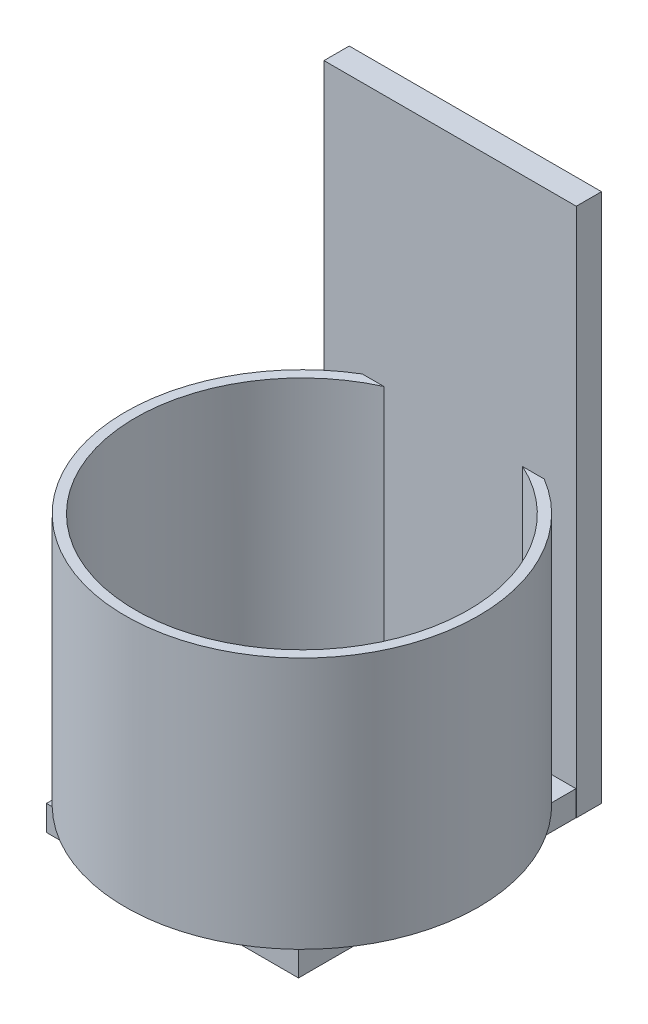
ISO-10303-21;
HEADER;
FILE_DESCRIPTION(('STEP AP214'),'2;1');
FILE_NAME('part.step','',(''),(''),'','','');
FILE_SCHEMA(('AUTOMOTIVE_DESIGN { 1 0 10303 214 1 1 1 1 }'));
ENDSEC;
DATA;
#1=APPLICATION_CONTEXT('core data for automotive mechanical design processes');
#2=APPLICATION_PROTOCOL_DEFINITION('international standard','automotive_design',2000,#1);
#3=PRODUCT_CONTEXT('',#1,'mechanical');
#4=PRODUCT('Part','Part','',(#3));
#5=PRODUCT_RELATED_PRODUCT_CATEGORY('part','',(#4));
#6=PRODUCT_DEFINITION_FORMATION('','',#4);
#7=PRODUCT_DEFINITION_CONTEXT('part definition',#1,'design');
#8=PRODUCT_DEFINITION('design','',#6,#7);
#9=PRODUCT_DEFINITION_SHAPE('','',#8);
#10=(LENGTH_UNIT() NAMED_UNIT(*) SI_UNIT(.MILLI.,.METRE.));
#11=(NAMED_UNIT(*) PLANE_ANGLE_UNIT() SI_UNIT($,.RADIAN.));
#12=(NAMED_UNIT(*) SI_UNIT($,.STERADIAN.) SOLID_ANGLE_UNIT());
#13=UNCERTAINTY_MEASURE_WITH_UNIT(LENGTH_MEASURE(1.E-05),#10,'distance_accuracy_value','');
#14=(GEOMETRIC_REPRESENTATION_CONTEXT(3) GLOBAL_UNCERTAINTY_ASSIGNED_CONTEXT((#13)) GLOBAL_UNIT_ASSIGNED_CONTEXT((#10,
#11,#12)) REPRESENTATION_CONTEXT('',''));
#15=CARTESIAN_POINT('',(0.,0.,0.));
#16=DIRECTION('',(0.,0.,1.));
#17=DIRECTION('',(1.,0.,0.));
#18=AXIS2_PLACEMENT_3D('',#15,#16,#17);
#19=CARTESIAN_POINT('',(0.,-127.,0.));
#20=DIRECTION('',(0.,1.,0.));
#21=DIRECTION('',(0.,0.,1.));
#22=AXIS2_PLACEMENT_3D('',#19,#20,#21);
#23=PLANE('',#22);
#24=DIRECTION('',(-1.,0.,0.));
#25=VECTOR('',#24,1.);
#26=CARTESIAN_POINT('',(0.,-127.,76.2));
#27=LINE('',#26,#25);
#28=CARTESIAN_POINT('',(59.8943849654527,-127.,76.2));
#29=VERTEX_POINT('',#28);
#30=CARTESIAN_POINT('',(5.18111052496603,-127.,76.2));
#31=VERTEX_POINT('',#30);
#32=EDGE_CURVE('E185',#29,#31,#27,.T.);
#33=ORIENTED_EDGE('',*,*,#32,.F.);
#34=CARTESIAN_POINT('',(32.5377477452093,-127.,44.45));
#35=DIRECTION('',(0.,1.,0.));
#36=DIRECTION('',(0.,0.,1.));
#37=AXIS2_PLACEMENT_3D('',#34,#35,#36);
#38=CIRCLE('',#37,41.91);
#39=CARTESIAN_POINT('',(63.4303237355036,-127.,72.7713143883524));
#40=VERTEX_POINT('',#39);
#41=EDGE_CURVE('E227',#29,#40,#38,.T.);
#42=ORIENTED_EDGE('',*,*,#41,.T.);
#43=DIRECTION('',(0.,0.,1.));
#44=VECTOR('',#43,1.);
#45=CARTESIAN_POINT('',(63.4303237355036,-127.,0.));
#46=LINE('',#45,#44);
#47=CARTESIAN_POINT('',(63.4303237355036,-127.,16.1286856116476));
#48=VERTEX_POINT('',#47);
#49=EDGE_CURVE('E235',#48,#40,#46,.T.);
#50=ORIENTED_EDGE('',*,*,#49,.F.);
#51=CARTESIAN_POINT('',(49.9973611429912,-127.,6.35));
#52=VERTEX_POINT('',#51);
#53=EDGE_CURVE('E229',#48,#52,#38,.T.);
#54=ORIENTED_EDGE('',*,*,#53,.T.);
#55=DIRECTION('',(-1.,0.,0.));
#56=VECTOR('',#55,1.);
#57=CARTESIAN_POINT('',(0.,-127.,6.35));
#58=LINE('',#57,#56);
#59=CARTESIAN_POINT('',(15.0781343474275,-127.,6.35));
#60=VERTEX_POINT('',#59);
#61=EDGE_CURVE('E198',#52,#60,#58,.T.);
#62=ORIENTED_EDGE('',*,*,#61,.T.);
#63=CARTESIAN_POINT('',(0.,-127.,18.0351732606642));
#64=VERTEX_POINT('',#63);
#65=EDGE_CURVE('E163',#60,#64,#38,.T.);
#66=ORIENTED_EDGE('',*,*,#65,.T.);
#67=DIRECTION('',(0.,0.,-1.));
#68=VECTOR('',#67,1.);
#69=CARTESIAN_POINT('',(0.,-127.,0.));
#70=LINE('',#69,#68);
#71=CARTESIAN_POINT('',(0.,-127.,70.8648267393358));
#72=VERTEX_POINT('',#71);
#73=EDGE_CURVE('E161',#72,#64,#70,.T.);
#74=ORIENTED_EDGE('',*,*,#73,.F.);
#75=CARTESIAN_POINT('',(32.5377477452093,-127.,44.45));
#76=DIRECTION('',(0.,1.,0.));
#77=DIRECTION('',(0.,0.,1.));
#78=AXIS2_PLACEMENT_3D('',#75,#76,#77);
#79=CIRCLE('',#78,41.91);
#80=EDGE_CURVE('E150',#31,#72,#79,.F.);
#81=ORIENTED_EDGE('',*,*,#80,.F.);
#82=EDGE_LOOP('',(#33,#42,#50,#54,#62,#66,#74,#81));
#83=FACE_BOUND('',#82,.T.);
#84=ADVANCED_FACE('F33',(#83),#23,.T.);
#85=CARTESIAN_POINT('',(32.5377477452093,-127.,44.45));
#86=DIRECTION('',(0.,1.,0.));
#87=DIRECTION('',(0.,0.,1.));
#88=AXIS2_PLACEMENT_3D('',#85,#86,#87);
#89=CIRCLE('',#88,44.45);
#90=CARTESIAN_POINT('',(63.4303237355036,-127.,12.4898490509838));
#91=VERTEX_POINT('',#90);
#92=CARTESIAN_POINT('',(55.4329983444057,-127.,6.35));
#93=VERTEX_POINT('',#92);
#94=EDGE_CURVE('E11',#91,#93,#89,.T.);
#95=ORIENTED_EDGE('',*,*,#94,.F.);
#96=CARTESIAN_POINT('',(63.4303237355036,-127.,6.35));
#97=VERTEX_POINT('',#96);
#98=EDGE_CURVE('E176',#97,#91,#46,.T.);
#99=ORIENTED_EDGE('',*,*,#98,.F.);
#100=EDGE_CURVE('E194',#97,#93,#58,.T.);
#101=ORIENTED_EDGE('',*,*,#100,.T.);
#102=EDGE_LOOP('',(#95,#99,#101));
#103=FACE_BOUND('',#102,.T.);
#104=ADVANCED_FACE('F296',(#103),#23,.T.);
#105=CARTESIAN_POINT('',(9.64249714601296,-127.,6.35));
#106=VERTEX_POINT('',#105);
#107=CARTESIAN_POINT('',(0.,-127.,14.1663827842656));
#108=VERTEX_POINT('',#107);
#109=EDGE_CURVE('E41',#106,#108,#89,.T.);
#110=ORIENTED_EDGE('',*,*,#109,.F.);
#111=CARTESIAN_POINT('',(0.,-127.,6.35));
#112=VERTEX_POINT('',#111);
#113=EDGE_CURVE('E193',#106,#112,#58,.T.);
#114=ORIENTED_EDGE('',*,*,#113,.T.);
#115=EDGE_CURVE('E171',#108,#112,#70,.T.);
#116=ORIENTED_EDGE('',*,*,#115,.F.);
#117=EDGE_LOOP('',(#110,#114,#116));
#118=FACE_BOUND('',#117,.T.);
#119=ADVANCED_FACE('F251',(#118),#23,.T.);
#120=CARTESIAN_POINT('',(0.,0.,6.35));
#121=DIRECTION('',(0.,0.,1.));
#122=DIRECTION('',(1.,0.,0.));
#123=AXIS2_PLACEMENT_3D('',#120,#121,#122);
#124=PLANE('',#123);
#125=DIRECTION('',(0.,1.,0.));
#126=VECTOR('',#125,1.);
#127=CARTESIAN_POINT('',(55.4329983444057,-252.723585694968,6.35));
#128=LINE('',#127,#126);
#129=CARTESIAN_POINT('',(55.4329983444057,-63.5,6.35));
#130=VERTEX_POINT('',#129);
#131=EDGE_CURVE('E264',#93,#130,#128,.T.);
#132=ORIENTED_EDGE('',*,*,#131,.F.);
#133=ORIENTED_EDGE('',*,*,#100,.F.);
#134=DIRECTION('',(0.,-1.,0.));
#135=VECTOR('',#134,1.);
#136=CARTESIAN_POINT('',(63.4303237355036,0.,6.35));
#137=LINE('',#136,#135);
#138=CARTESIAN_POINT('',(63.4303237355036,-133.35,6.35));
#139=VERTEX_POINT('',#138);
#140=EDGE_CURVE('E191',#97,#139,#137,.T.);
#141=ORIENTED_EDGE('',*,*,#140,.T.);
#142=DIRECTION('',(-1.,0.,0.));
#143=VECTOR('',#142,1.);
#144=CARTESIAN_POINT('',(63.5,-133.35,6.35));
#145=LINE('',#144,#143);
#146=CARTESIAN_POINT('',(63.5,-133.35,6.35));
#147=VERTEX_POINT('',#146);
#148=EDGE_CURVE('E206',#147,#139,#145,.T.);
#149=ORIENTED_EDGE('',*,*,#148,.F.);
#150=DIRECTION('',(0.,1.,0.));
#151=VECTOR('',#150,1.);
#152=CARTESIAN_POINT('',(63.5,0.,6.35));
#153=LINE('',#152,#151);
#154=CARTESIAN_POINT('',(63.5,0.,6.35));
#155=VERTEX_POINT('',#154);
#156=EDGE_CURVE('E213',#147,#155,#153,.T.);
#157=ORIENTED_EDGE('',*,*,#156,.T.);
#158=DIRECTION('',(-1.,0.,0.));
#159=VECTOR('',#158,1.);
#160=CARTESIAN_POINT('',(0.,0.,6.35));
#161=LINE('',#160,#159);
#162=CARTESIAN_POINT('',(0.,0.,6.35));
#163=VERTEX_POINT('',#162);
#164=EDGE_CURVE('E216',#155,#163,#161,.T.);
#165=ORIENTED_EDGE('',*,*,#164,.T.);
#166=DIRECTION('',(0.,-1.,0.));
#167=VECTOR('',#166,1.);
#168=CARTESIAN_POINT('',(0.,0.,6.35));
#169=LINE('',#168,#167);
#170=EDGE_CURVE('E210',#163,#112,#169,.T.);
#171=ORIENTED_EDGE('',*,*,#170,.T.);
#172=ORIENTED_EDGE('',*,*,#113,.F.);
#173=DIRECTION('',(0.,1.,0.));
#174=VECTOR('',#173,1.);
#175=CARTESIAN_POINT('',(9.64249714601296,-252.723585694968,6.35));
#176=LINE('',#175,#174);
#177=CARTESIAN_POINT('',(9.64249714601296,-63.5,6.35));
#178=VERTEX_POINT('',#177);
#179=EDGE_CURVE('E402',#178,#106,#176,.F.);
#180=ORIENTED_EDGE('',*,*,#179,.F.);
#181=DIRECTION('',(-1.,0.,0.));
#182=VECTOR('',#181,1.);
#183=CARTESIAN_POINT('',(0.,-63.5,6.35));
#184=LINE('',#183,#182);
#185=CARTESIAN_POINT('',(15.0781343474275,-63.5,6.35));
#186=VERTEX_POINT('',#185);
#187=EDGE_CURVE('E258',#186,#178,#184,.T.);
#188=ORIENTED_EDGE('',*,*,#187,.F.);
#189=DIRECTION('',(0.,1.,0.));
#190=VECTOR('',#189,1.);
#191=CARTESIAN_POINT('',(15.0781343474275,-252.723585694968,6.35));
#192=LINE('',#191,#190);
#193=EDGE_CURVE('E245',#186,#60,#192,.F.);
#194=ORIENTED_EDGE('',*,*,#193,.T.);
#195=ORIENTED_EDGE('',*,*,#61,.F.);
#196=DIRECTION('',(0.,1.,0.));
#197=VECTOR('',#196,1.);
#198=CARTESIAN_POINT('',(49.9973611429912,-252.723585694968,6.35));
#199=LINE('',#198,#197);
#200=CARTESIAN_POINT('',(49.9973611429912,-63.5,6.35));
#201=VERTEX_POINT('',#200);
#202=EDGE_CURVE('E243',#52,#201,#199,.T.);
#203=ORIENTED_EDGE('',*,*,#202,.T.);
#204=EDGE_CURVE('E257',#130,#201,#184,.T.);
#205=ORIENTED_EDGE('',*,*,#204,.F.);
#206=EDGE_LOOP('',(#132,#133,#141,#149,#157,#165,#171,#172,#180,#188,#194,#195,#203,#205));
#207=FACE_BOUND('',#206,.T.);
#208=ADVANCED_FACE('F241',(#207),#124,.T.);
#209=CARTESIAN_POINT('',(0.,0.,6.35));
#210=DIRECTION('',(1.,0.,0.));
#211=DIRECTION('',(0.,0.,-1.));
#212=AXIS2_PLACEMENT_3D('',#209,#210,#211);
#213=PLANE('',#212);
#214=DIRECTION('',(0.,-1.,0.));
#215=VECTOR('',#214,1.);
#216=CARTESIAN_POINT('',(0.,0.,0.));
#217=LINE('',#216,#215);
#218=CARTESIAN_POINT('',(0.,0.,0.));
#219=VERTEX_POINT('',#218);
#220=CARTESIAN_POINT('',(0.,-133.35,0.));
#221=VERTEX_POINT('',#220);
#222=EDGE_CURVE('E209',#219,#221,#217,.T.);
#223=ORIENTED_EDGE('',*,*,#222,.T.);
#224=DIRECTION('',(0.,0.,-1.));
#225=VECTOR('',#224,1.);
#226=CARTESIAN_POINT('',(0.,-133.35,6.35));
#227=LINE('',#226,#225);
#228=CARTESIAN_POINT('',(0.,-133.35,76.2));
#229=VERTEX_POINT('',#228);
#230=EDGE_CURVE('E197',#229,#221,#227,.T.);
#231=ORIENTED_EDGE('',*,*,#230,.F.);
#232=DIRECTION('',(0.,1.,0.));
#233=VECTOR('',#232,1.);
#234=CARTESIAN_POINT('',(0.,-133.35,76.2));
#235=LINE('',#234,#233);
#236=CARTESIAN_POINT('',(0.,-127.,76.2));
#237=VERTEX_POINT('',#236);
#238=EDGE_CURVE('E186',#229,#237,#235,.T.);
#239=ORIENTED_EDGE('',*,*,#238,.T.);
#240=CARTESIAN_POINT('',(0.,-127.,74.7336172157344));
#241=VERTEX_POINT('',#240);
#242=EDGE_CURVE('E169',#237,#241,#70,.T.);
#243=ORIENTED_EDGE('',*,*,#242,.T.);
#244=EDGE_CURVE('E145',#241,#72,#70,.T.);
#245=ORIENTED_EDGE('',*,*,#244,.T.);
#246=ORIENTED_EDGE('',*,*,#73,.T.);
#247=EDGE_CURVE('E148',#64,#108,#70,.T.);
#248=ORIENTED_EDGE('',*,*,#247,.T.);
#249=ORIENTED_EDGE('',*,*,#115,.T.);
#250=ORIENTED_EDGE('',*,*,#170,.F.);
#251=DIRECTION('',(0.,0.,-1.));
#252=VECTOR('',#251,1.);
#253=CARTESIAN_POINT('',(0.,0.,6.35));
#254=LINE('',#253,#252);
#255=EDGE_CURVE('E218',#163,#219,#254,.T.);
#256=ORIENTED_EDGE('',*,*,#255,.T.);
#257=EDGE_LOOP('',(#223,#231,#239,#243,#245,#246,#248,#249,#250,#256));
#258=FACE_BOUND('',#257,.T.);
#259=ADVANCED_FACE('F35',(#258),#213,.F.);
#260=CARTESIAN_POINT('',(63.5,0.,6.35));
#261=DIRECTION('',(-1.,0.,0.));
#262=DIRECTION('',(0.,-1.,0.));
#263=AXIS2_PLACEMENT_3D('',#260,#261,#262);
#264=PLANE('',#263);
#265=DIRECTION('',(0.,1.,0.));
#266=VECTOR('',#265,1.);
#267=CARTESIAN_POINT('',(63.5,0.,0.));
#268=LINE('',#267,#266);
#269=CARTESIAN_POINT('',(63.5,-133.35,0.));
#270=VERTEX_POINT('',#269);
#271=CARTESIAN_POINT('',(63.5,0.,0.));
#272=VERTEX_POINT('',#271);
#273=EDGE_CURVE('E220',#270,#272,#268,.T.);
#274=ORIENTED_EDGE('',*,*,#273,.T.);
#275=DIRECTION('',(0.,0.,-1.));
#276=VECTOR('',#275,1.);
#277=CARTESIAN_POINT('',(63.5,0.,6.35));
#278=LINE('',#277,#276);
#279=EDGE_CURVE('E225',#155,#272,#278,.T.);
#280=ORIENTED_EDGE('',*,*,#279,.F.);
#281=ORIENTED_EDGE('',*,*,#156,.F.);
#282=DIRECTION('',(0.,0.,1.));
#283=VECTOR('',#282,1.);
#284=CARTESIAN_POINT('',(63.5,-133.35,0.));
#285=LINE('',#284,#283);
#286=EDGE_CURVE('E203',#270,#147,#285,.T.);
#287=ORIENTED_EDGE('',*,*,#286,.F.);
#288=EDGE_LOOP('',(#274,#280,#281,#287));
#289=FACE_BOUND('',#288,.T.);
#290=ADVANCED_FACE('F305',(#289),#264,.F.);
#291=CARTESIAN_POINT('',(0.,0.,6.35));
#292=DIRECTION('',(0.,-1.,0.));
#293=DIRECTION('',(0.,0.,-1.));
#294=AXIS2_PLACEMENT_3D('',#291,#292,#293);
#295=PLANE('',#294);
#296=DIRECTION('',(-1.,0.,0.));
#297=VECTOR('',#296,1.);
#298=CARTESIAN_POINT('',(0.,0.,0.));
#299=LINE('',#298,#297);
#300=EDGE_CURVE('E214',#272,#219,#299,.T.);
#301=ORIENTED_EDGE('',*,*,#300,.T.);
#302=ORIENTED_EDGE('',*,*,#255,.F.);
#303=ORIENTED_EDGE('',*,*,#164,.F.);
#304=ORIENTED_EDGE('',*,*,#279,.T.);
#305=EDGE_LOOP('',(#301,#302,#303,#304));
#306=FACE_BOUND('',#305,.T.);
#307=ADVANCED_FACE('F309',(#306),#295,.F.);
#308=CARTESIAN_POINT('',(0.,0.,0.));
#309=DIRECTION('',(0.,0.,1.));
#310=DIRECTION('',(1.,0.,0.));
#311=AXIS2_PLACEMENT_3D('',#308,#309,#310);
#312=PLANE('',#311);
#313=ORIENTED_EDGE('',*,*,#273,.F.);
#314=DIRECTION('',(1.,0.,0.));
#315=VECTOR('',#314,1.);
#316=CARTESIAN_POINT('',(0.,-133.35,0.));
#317=LINE('',#316,#315);
#318=EDGE_CURVE('E201',#221,#270,#317,.T.);
#319=ORIENTED_EDGE('',*,*,#318,.F.);
#320=ORIENTED_EDGE('',*,*,#222,.F.);
#321=ORIENTED_EDGE('',*,*,#300,.F.);
#322=EDGE_LOOP('',(#313,#319,#320,#321));
#323=FACE_BOUND('',#322,.T.);
#324=ADVANCED_FACE('F311',(#323),#312,.F.);
#325=CARTESIAN_POINT('',(0.,-133.35,0.));
#326=DIRECTION('',(0.,-1.,0.));
#327=DIRECTION('',(0.,0.,-1.));
#328=AXIS2_PLACEMENT_3D('',#325,#326,#327);
#329=PLANE('',#328);
#330=ORIENTED_EDGE('',*,*,#318,.T.);
#331=ORIENTED_EDGE('',*,*,#286,.T.);
#332=ORIENTED_EDGE('',*,*,#148,.T.);
#333=DIRECTION('',(0.,0.,1.));
#334=VECTOR('',#333,1.);
#335=CARTESIAN_POINT('',(63.4303237355036,-133.35,0.));
#336=LINE('',#335,#334);
#337=CARTESIAN_POINT('',(63.4303237355036,-133.35,76.2));
#338=VERTEX_POINT('',#337);
#339=EDGE_CURVE('E184',#139,#338,#336,.T.);
#340=ORIENTED_EDGE('',*,*,#339,.T.);
#341=DIRECTION('',(-1.,0.,0.));
#342=VECTOR('',#341,1.);
#343=CARTESIAN_POINT('',(0.,-133.35,76.2));
#344=LINE('',#343,#342);
#345=EDGE_CURVE('E174',#338,#229,#344,.T.);
#346=ORIENTED_EDGE('',*,*,#345,.T.);
#347=ORIENTED_EDGE('',*,*,#230,.T.);
#348=EDGE_LOOP('',(#330,#331,#332,#340,#346,#347));
#349=FACE_BOUND('',#348,.T.);
#350=ADVANCED_FACE('F273',(#349),#329,.T.);
#351=CARTESIAN_POINT('',(63.4303237355036,-133.35,0.));
#352=DIRECTION('',(-1.,0.,0.));
#353=DIRECTION('',(0.,0.,1.));
#354=AXIS2_PLACEMENT_3D('',#351,#352,#353);
#355=PLANE('',#354);
#356=ORIENTED_EDGE('',*,*,#140,.F.);
#357=ORIENTED_EDGE('',*,*,#98,.T.);
#358=EDGE_CURVE('E180',#91,#48,#46,.T.);
#359=ORIENTED_EDGE('',*,*,#358,.T.);
#360=ORIENTED_EDGE('',*,*,#49,.T.);
#361=CARTESIAN_POINT('',(63.4303237355036,-127.,76.2));
#362=VERTEX_POINT('',#361);
#363=EDGE_CURVE('E170',#40,#362,#46,.T.);
#364=ORIENTED_EDGE('',*,*,#363,.T.);
#365=DIRECTION('',(0.,1.,0.));
#366=VECTOR('',#365,1.);
#367=CARTESIAN_POINT('',(63.4303237355036,-133.35,76.2));
#368=LINE('',#367,#366);
#369=EDGE_CURVE('E188',#338,#362,#368,.T.);
#370=ORIENTED_EDGE('',*,*,#369,.F.);
#371=ORIENTED_EDGE('',*,*,#339,.F.);
#372=EDGE_LOOP('',(#356,#357,#359,#360,#364,#370,#371));
#373=FACE_BOUND('',#372,.T.);
#374=ADVANCED_FACE('F299',(#373),#355,.F.);
#375=CARTESIAN_POINT('',(0.,-133.35,76.2));
#376=DIRECTION('',(0.,0.,-1.));
#377=DIRECTION('',(-1.,0.,0.));
#378=AXIS2_PLACEMENT_3D('',#375,#376,#377);
#379=PLANE('',#378);
#380=EDGE_CURVE('E181',#362,#29,#27,.T.);
#381=ORIENTED_EDGE('',*,*,#380,.T.);
#382=ORIENTED_EDGE('',*,*,#32,.T.);
#383=CARTESIAN_POINT('',(1.42922801186295,-127.,76.2));
#384=VERTEX_POINT('',#383);
#385=EDGE_CURVE('E291',#31,#384,#27,.T.);
#386=ORIENTED_EDGE('',*,*,#385,.T.);
#387=EDGE_CURVE('E179',#384,#237,#27,.T.);
#388=ORIENTED_EDGE('',*,*,#387,.T.);
#389=ORIENTED_EDGE('',*,*,#238,.F.);
#390=ORIENTED_EDGE('',*,*,#345,.F.);
#391=ORIENTED_EDGE('',*,*,#369,.T.);
#392=EDGE_LOOP('',(#381,#382,#386,#388,#389,#390,#391));
#393=FACE_BOUND('',#392,.T.);
#394=ADVANCED_FACE('F275',(#393),#379,.F.);
#395=CARTESIAN_POINT('',(32.5377477452093,-127.,44.45));
#396=DIRECTION('',(0.,1.,0.));
#397=DIRECTION('',(0.,0.,1.));
#398=AXIS2_PLACEMENT_3D('',#395,#396,#397);
#399=CIRCLE('',#398,44.45);
#400=EDGE_CURVE('E282',#384,#241,#399,.F.);
#401=ORIENTED_EDGE('',*,*,#400,.T.);
#402=ORIENTED_EDGE('',*,*,#242,.F.);
#403=ORIENTED_EDGE('',*,*,#387,.F.);
#404=EDGE_LOOP('',(#401,#402,#403));
#405=FACE_BOUND('',#404,.T.);
#406=ADVANCED_FACE('F280',(#405),#23,.T.);
#407=CARTESIAN_POINT('',(0.,-127.,0.));
#408=DIRECTION('',(0.,1.,0.));
#409=DIRECTION('',(0.,0.,1.));
#410=AXIS2_PLACEMENT_3D('',#407,#408,#409);
#411=PLANE('',#410);
#412=EDGE_CURVE('E285',#241,#108,#399,.F.);
#413=ORIENTED_EDGE('',*,*,#412,.T.);
#414=ORIENTED_EDGE('',*,*,#247,.F.);
#415=EDGE_CURVE('E54',#72,#64,#79,.F.);
#416=ORIENTED_EDGE('',*,*,#415,.F.);
#417=ORIENTED_EDGE('',*,*,#244,.F.);
#418=EDGE_LOOP('',(#413,#414,#416,#417));
#419=FACE_BOUND('',#418,.T.);
#420=ADVANCED_FACE('F143',(#419),#411,.F.);
#421=EDGE_CURVE('E151',#48,#40,#79,.F.);
#422=ORIENTED_EDGE('',*,*,#421,.F.);
#423=ORIENTED_EDGE('',*,*,#358,.F.);
#424=EDGE_CURVE('E159',#91,#384,#399,.F.);
#425=ORIENTED_EDGE('',*,*,#424,.T.);
#426=ORIENTED_EDGE('',*,*,#385,.F.);
#427=EDGE_CURVE('E48',#29,#31,#79,.F.);
#428=ORIENTED_EDGE('',*,*,#427,.F.);
#429=ORIENTED_EDGE('',*,*,#380,.F.);
#430=ORIENTED_EDGE('',*,*,#363,.F.);
#431=EDGE_LOOP('',(#422,#423,#425,#426,#428,#429,#430));
#432=FACE_BOUND('',#431,.T.);
#433=ADVANCED_FACE('F290',(#432),#411,.F.);
#434=CARTESIAN_POINT('',(32.5377477452093,-252.723585694968,44.45));
#435=DIRECTION('',(0.,1.,0.));
#436=DIRECTION('',(0.,0.,1.));
#437=AXIS2_PLACEMENT_3D('',#434,#435,#436);
#438=CYLINDRICAL_SURFACE('',#437,44.45);
#439=ORIENTED_EDGE('',*,*,#94,.T.);
#440=ORIENTED_EDGE('',*,*,#131,.T.);
#441=CARTESIAN_POINT('',(32.5377477452093,-63.5,44.45));
#442=DIRECTION('',(0.,1.,0.));
#443=DIRECTION('',(0.,0.,1.));
#444=AXIS2_PLACEMENT_3D('',#441,#442,#443);
#445=CIRCLE('',#444,44.45);
#446=EDGE_CURVE('E399',#178,#130,#445,.T.);
#447=ORIENTED_EDGE('',*,*,#446,.F.);
#448=ORIENTED_EDGE('',*,*,#179,.T.);
#449=ORIENTED_EDGE('',*,*,#109,.T.);
#450=ORIENTED_EDGE('',*,*,#412,.F.);
#451=ORIENTED_EDGE('',*,*,#400,.F.);
#452=ORIENTED_EDGE('',*,*,#424,.F.);
#453=EDGE_LOOP('',(#439,#440,#447,#448,#449,#450,#451,#452));
#454=FACE_BOUND('',#453,.T.);
#455=ADVANCED_FACE('F293',(#454),#438,.T.);
#456=CARTESIAN_POINT('',(32.5377477452093,-63.5,44.45));
#457=DIRECTION('',(0.,1.,0.));
#458=DIRECTION('',(0.,0.,1.));
#459=AXIS2_PLACEMENT_3D('',#456,#457,#458);
#460=PLANE('',#459);
#461=ORIENTED_EDGE('',*,*,#446,.T.);
#462=ORIENTED_EDGE('',*,*,#204,.T.);
#463=CARTESIAN_POINT('',(32.5377477452093,-63.5,44.45));
#464=DIRECTION('',(0.,1.,0.));
#465=DIRECTION('',(0.,0.,1.));
#466=AXIS2_PLACEMENT_3D('',#463,#464,#465);
#467=CIRCLE('',#466,41.91);
#468=EDGE_CURVE('E400',#186,#201,#467,.T.);
#469=ORIENTED_EDGE('',*,*,#468,.F.);
#470=ORIENTED_EDGE('',*,*,#187,.T.);
#471=EDGE_LOOP('',(#461,#462,#469,#470));
#472=FACE_BOUND('',#471,.T.);
#473=ADVANCED_FACE('F379',(#472),#460,.T.);
#474=CARTESIAN_POINT('',(32.5377477452093,-252.723585694968,44.45));
#475=DIRECTION('',(0.,1.,0.));
#476=DIRECTION('',(0.,0.,1.));
#477=AXIS2_PLACEMENT_3D('',#474,#475,#476);
#478=CYLINDRICAL_SURFACE('',#477,41.91);
#479=ORIENTED_EDGE('',*,*,#202,.F.);
#480=ORIENTED_EDGE('',*,*,#53,.F.);
#481=ORIENTED_EDGE('',*,*,#421,.T.);
#482=ORIENTED_EDGE('',*,*,#41,.F.);
#483=ORIENTED_EDGE('',*,*,#427,.T.);
#484=ORIENTED_EDGE('',*,*,#80,.T.);
#485=ORIENTED_EDGE('',*,*,#415,.T.);
#486=ORIENTED_EDGE('',*,*,#65,.F.);
#487=ORIENTED_EDGE('',*,*,#193,.F.);
#488=ORIENTED_EDGE('',*,*,#468,.T.);
#489=EDGE_LOOP('',(#479,#480,#481,#482,#483,#484,#485,#486,#487,#488));
#490=FACE_BOUND('',#489,.T.);
#491=ADVANCED_FACE('F155',(#490),#478,.F.);
#492=CLOSED_SHELL('',(#84,#104,#119,#208,#259,#290,#307,#324,#350,#374,#394,#406,#420,#433,#455,
#473,#491));
#493=MANIFOLD_SOLID_BREP('B2',#492);
#494=ADVANCED_BREP_SHAPE_REPRESENTATION('',(#18,#493),#14);
#495=SHAPE_DEFINITION_REPRESENTATION(#9,#494);
ENDSEC;
END-ISO-10303-21;
